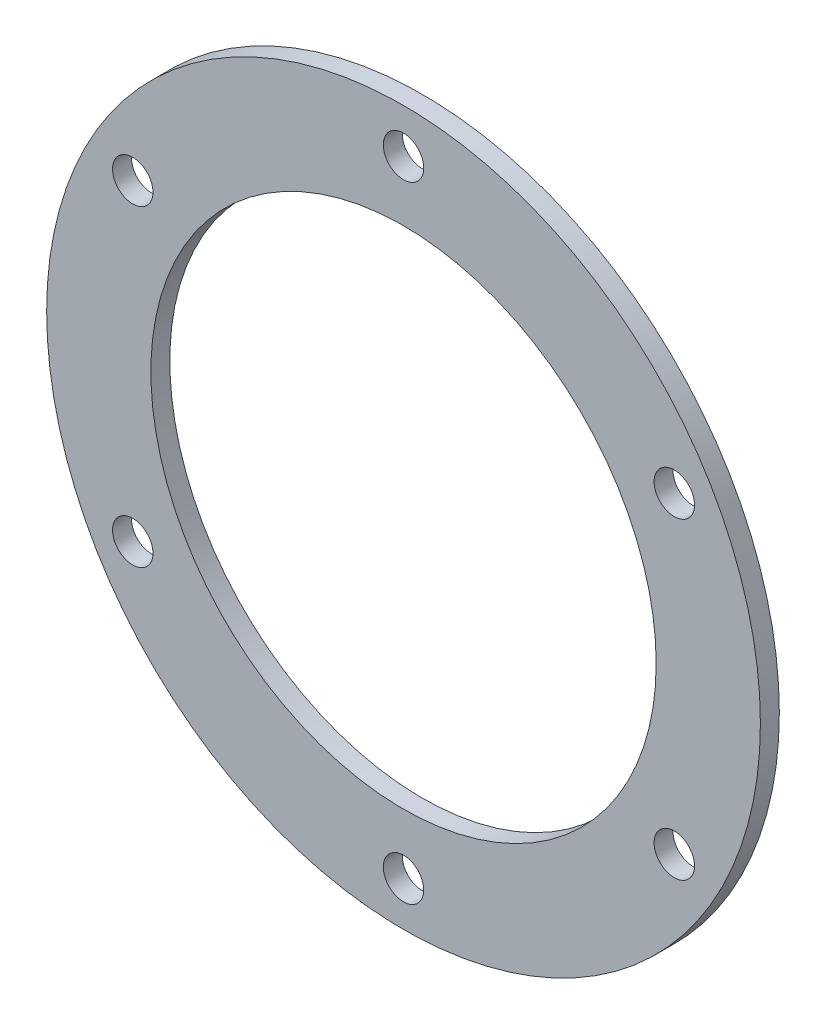
ISO-10303-21;
HEADER;
FILE_DESCRIPTION(('STEP AP214'),'2;1');
FILE_NAME('part.step','',(''),(''),'','','');
FILE_SCHEMA(('AUTOMOTIVE_DESIGN { 1 0 10303 214 1 1 1 1 }'));
ENDSEC;
DATA;
#1=APPLICATION_CONTEXT('core data for automotive mechanical design processes');
#2=APPLICATION_PROTOCOL_DEFINITION('international standard','automotive_design',2000,#1);
#3=PRODUCT_CONTEXT('',#1,'mechanical');
#4=PRODUCT('Part','Part','',(#3));
#5=PRODUCT_RELATED_PRODUCT_CATEGORY('part','',(#4));
#6=PRODUCT_DEFINITION_FORMATION('','',#4);
#7=PRODUCT_DEFINITION_CONTEXT('part definition',#1,'design');
#8=PRODUCT_DEFINITION('design','',#6,#7);
#9=PRODUCT_DEFINITION_SHAPE('','',#8);
#10=(LENGTH_UNIT() NAMED_UNIT(*) SI_UNIT(.MILLI.,.METRE.));
#11=(NAMED_UNIT(*) PLANE_ANGLE_UNIT() SI_UNIT($,.RADIAN.));
#12=(NAMED_UNIT(*) SI_UNIT($,.STERADIAN.) SOLID_ANGLE_UNIT());
#13=UNCERTAINTY_MEASURE_WITH_UNIT(LENGTH_MEASURE(1.E-05),#10,'distance_accuracy_value','');
#14=(GEOMETRIC_REPRESENTATION_CONTEXT(3) GLOBAL_UNCERTAINTY_ASSIGNED_CONTEXT((#13)) GLOBAL_UNIT_ASSIGNED_CONTEXT((#10,
#11,#12)) REPRESENTATION_CONTEXT('',''));
#15=CARTESIAN_POINT('',(0.,0.,0.));
#16=DIRECTION('',(0.,0.,1.));
#17=DIRECTION('',(1.,0.,0.));
#18=AXIS2_PLACEMENT_3D('',#15,#16,#17);
#19=CARTESIAN_POINT('',(0.,0.,1.5));
#20=DIRECTION('',(0.,0.,1.));
#21=DIRECTION('',(1.,0.,0.));
#22=AXIS2_PLACEMENT_3D('',#19,#20,#21);
#23=PLANE('',#22);
#24=CARTESIAN_POINT('',(0.,24.75,1.5));
#25=DIRECTION('',(0.,0.,1.));
#26=DIRECTION('',(1.,0.,0.));
#27=AXIS2_PLACEMENT_3D('',#24,#25,#26);
#28=CIRCLE('',#27,1.6);
#29=CARTESIAN_POINT('',(1.6,24.75,1.5));
#30=VERTEX_POINT('',#29);
#31=EDGE_CURVE('E75',#30,#30,#28,.T.);
#32=ORIENTED_EDGE('',*,*,#31,.F.);
#33=EDGE_LOOP('',(#32));
#34=FACE_BOUND('',#33,.T.);
#35=CARTESIAN_POINT('',(-21.4341287436649,12.375,1.5));
#36=DIRECTION('',(0.,0.,1.));
#37=DIRECTION('',(1.,0.,0.));
#38=AXIS2_PLACEMENT_3D('',#35,#36,#37);
#39=CIRCLE('',#38,1.6);
#40=CARTESIAN_POINT('',(-19.8341287436649,12.375,1.5));
#41=VERTEX_POINT('',#40);
#42=EDGE_CURVE('E80',#41,#41,#39,.T.);
#43=ORIENTED_EDGE('',*,*,#42,.F.);
#44=EDGE_LOOP('',(#43));
#45=FACE_BOUND('',#44,.T.);
#46=CARTESIAN_POINT('',(-21.4341287436649,-12.375,1.5));
#47=DIRECTION('',(0.,0.,1.));
#48=DIRECTION('',(1.,0.,0.));
#49=AXIS2_PLACEMENT_3D('',#46,#47,#48);
#50=CIRCLE('',#49,1.6);
#51=CARTESIAN_POINT('',(-19.8341287436649,-12.375,1.5));
#52=VERTEX_POINT('',#51);
#53=EDGE_CURVE('E56',#52,#52,#50,.T.);
#54=ORIENTED_EDGE('',*,*,#53,.F.);
#55=EDGE_LOOP('',(#54));
#56=FACE_BOUND('',#55,.T.);
#57=CARTESIAN_POINT('',(0.,-24.75,1.5));
#58=DIRECTION('',(0.,0.,1.));
#59=DIRECTION('',(1.,0.,0.));
#60=AXIS2_PLACEMENT_3D('',#57,#58,#59);
#61=CIRCLE('',#60,1.6);
#62=CARTESIAN_POINT('',(1.6,-24.75,1.5));
#63=VERTEX_POINT('',#62);
#64=EDGE_CURVE('E55',#63,#63,#61,.T.);
#65=ORIENTED_EDGE('',*,*,#64,.F.);
#66=EDGE_LOOP('',(#65));
#67=FACE_BOUND('',#66,.T.);
#68=CARTESIAN_POINT('',(21.4341287436649,-12.375,1.5));
#69=DIRECTION('',(0.,0.,1.));
#70=DIRECTION('',(1.,0.,0.));
#71=AXIS2_PLACEMENT_3D('',#68,#69,#70);
#72=CIRCLE('',#71,1.6);
#73=CARTESIAN_POINT('',(23.0341287436649,-12.375,1.5));
#74=VERTEX_POINT('',#73);
#75=EDGE_CURVE('E63',#74,#74,#72,.T.);
#76=ORIENTED_EDGE('',*,*,#75,.F.);
#77=EDGE_LOOP('',(#76));
#78=FACE_BOUND('',#77,.T.);
#79=CARTESIAN_POINT('',(21.4341287436649,12.375,1.5));
#80=DIRECTION('',(0.,0.,1.));
#81=DIRECTION('',(1.,0.,0.));
#82=AXIS2_PLACEMENT_3D('',#79,#80,#81);
#83=CIRCLE('',#82,1.6);
#84=CARTESIAN_POINT('',(23.0341287436649,12.375,1.5));
#85=VERTEX_POINT('',#84);
#86=EDGE_CURVE('E69',#85,#85,#83,.T.);
#87=ORIENTED_EDGE('',*,*,#86,.F.);
#88=EDGE_LOOP('',(#87));
#89=FACE_BOUND('',#88,.T.);
#90=CARTESIAN_POINT('',(0.,0.,1.5));
#91=DIRECTION('',(0.,0.,1.));
#92=DIRECTION('',(1.,0.,0.));
#93=AXIS2_PLACEMENT_3D('',#90,#91,#92);
#94=CIRCLE('',#93,28.25);
#95=CARTESIAN_POINT('',(28.25,0.,1.5));
#96=VERTEX_POINT('',#95);
#97=EDGE_CURVE('E10',#96,#96,#94,.T.);
#98=ORIENTED_EDGE('',*,*,#97,.T.);
#99=EDGE_LOOP('',(#98));
#100=FACE_BOUND('',#99,.T.);
#101=CARTESIAN_POINT('',(0.,0.,1.5));
#102=DIRECTION('',(0.,0.,1.));
#103=DIRECTION('',(1.,0.,0.));
#104=AXIS2_PLACEMENT_3D('',#101,#102,#103);
#105=CIRCLE('',#104,20.);
#106=CARTESIAN_POINT('',(20.,0.,1.5));
#107=VERTEX_POINT('',#106);
#108=EDGE_CURVE('E44',#107,#107,#105,.T.);
#109=ORIENTED_EDGE('',*,*,#108,.F.);
#110=EDGE_LOOP('',(#109));
#111=FACE_BOUND('',#110,.T.);
#112=ADVANCED_FACE('F33',(#34,#45,#56,#67,#78,#89,#100,#111),#23,.T.);
#113=CARTESIAN_POINT('',(0.,0.,0.));
#114=DIRECTION('',(0.,0.,1.));
#115=DIRECTION('',(1.,0.,0.));
#116=AXIS2_PLACEMENT_3D('',#113,#114,#115);
#117=PLANE('',#116);
#118=CARTESIAN_POINT('',(0.,24.75,0.));
#119=DIRECTION('',(0.,0.,1.));
#120=DIRECTION('',(1.,0.,0.));
#121=AXIS2_PLACEMENT_3D('',#118,#119,#120);
#122=CIRCLE('',#121,1.6);
#123=CARTESIAN_POINT('',(1.6,24.75,0.));
#124=VERTEX_POINT('',#123);
#125=EDGE_CURVE('E49',#124,#124,#122,.F.);
#126=ORIENTED_EDGE('',*,*,#125,.F.);
#127=EDGE_LOOP('',(#126));
#128=FACE_BOUND('',#127,.T.);
#129=CARTESIAN_POINT('',(-21.4341287436649,12.375,0.));
#130=DIRECTION('',(0.,0.,1.));
#131=DIRECTION('',(1.,0.,0.));
#132=AXIS2_PLACEMENT_3D('',#129,#130,#131);
#133=CIRCLE('',#132,1.6);
#134=CARTESIAN_POINT('',(-19.8341287436649,12.375,0.));
#135=VERTEX_POINT('',#134);
#136=EDGE_CURVE('E59',#135,#135,#133,.F.);
#137=ORIENTED_EDGE('',*,*,#136,.F.);
#138=EDGE_LOOP('',(#137));
#139=FACE_BOUND('',#138,.T.);
#140=CARTESIAN_POINT('',(-21.4341287436649,-12.375,0.));
#141=DIRECTION('',(0.,0.,1.));
#142=DIRECTION('',(1.,0.,0.));
#143=AXIS2_PLACEMENT_3D('',#140,#141,#142);
#144=CIRCLE('',#143,1.6);
#145=CARTESIAN_POINT('',(-19.8341287436649,-12.375,0.));
#146=VERTEX_POINT('',#145);
#147=EDGE_CURVE('E52',#146,#146,#144,.F.);
#148=ORIENTED_EDGE('',*,*,#147,.F.);
#149=EDGE_LOOP('',(#148));
#150=FACE_BOUND('',#149,.T.);
#151=CARTESIAN_POINT('',(0.,-24.75,0.));
#152=DIRECTION('',(0.,0.,1.));
#153=DIRECTION('',(1.,0.,0.));
#154=AXIS2_PLACEMENT_3D('',#151,#152,#153);
#155=CIRCLE('',#154,1.6);
#156=CARTESIAN_POINT('',(1.6,-24.75,0.));
#157=VERTEX_POINT('',#156);
#158=EDGE_CURVE('E60',#157,#157,#155,.F.);
#159=ORIENTED_EDGE('',*,*,#158,.F.);
#160=EDGE_LOOP('',(#159));
#161=FACE_BOUND('',#160,.T.);
#162=CARTESIAN_POINT('',(21.4341287436649,-12.375,0.));
#163=DIRECTION('',(0.,0.,1.));
#164=DIRECTION('',(1.,0.,0.));
#165=AXIS2_PLACEMENT_3D('',#162,#163,#164);
#166=CIRCLE('',#165,1.6);
#167=CARTESIAN_POINT('',(23.0341287436649,-12.375,0.));
#168=VERTEX_POINT('',#167);
#169=EDGE_CURVE('E66',#168,#168,#166,.F.);
#170=ORIENTED_EDGE('',*,*,#169,.F.);
#171=EDGE_LOOP('',(#170));
#172=FACE_BOUND('',#171,.T.);
#173=CARTESIAN_POINT('',(21.4341287436649,12.375,0.));
#174=DIRECTION('',(0.,0.,1.));
#175=DIRECTION('',(1.,0.,0.));
#176=AXIS2_PLACEMENT_3D('',#173,#174,#175);
#177=CIRCLE('',#176,1.6);
#178=CARTESIAN_POINT('',(23.0341287436649,12.375,0.));
#179=VERTEX_POINT('',#178);
#180=EDGE_CURVE('E72',#179,#179,#177,.F.);
#181=ORIENTED_EDGE('',*,*,#180,.F.);
#182=EDGE_LOOP('',(#181));
#183=FACE_BOUND('',#182,.T.);
#184=CARTESIAN_POINT('',(0.,0.,0.));
#185=DIRECTION('',(0.,0.,1.));
#186=DIRECTION('',(1.,0.,0.));
#187=AXIS2_PLACEMENT_3D('',#184,#185,#186);
#188=CIRCLE('',#187,28.25);
#189=CARTESIAN_POINT('',(28.25,0.,0.));
#190=VERTEX_POINT('',#189);
#191=EDGE_CURVE('E37',#190,#190,#188,.T.);
#192=ORIENTED_EDGE('',*,*,#191,.F.);
#193=EDGE_LOOP('',(#192));
#194=FACE_BOUND('',#193,.T.);
#195=CARTESIAN_POINT('',(0.,0.,0.));
#196=DIRECTION('',(0.,0.,1.));
#197=DIRECTION('',(1.,0.,0.));
#198=AXIS2_PLACEMENT_3D('',#195,#196,#197);
#199=CIRCLE('',#198,20.);
#200=CARTESIAN_POINT('',(20.,0.,0.));
#201=VERTEX_POINT('',#200);
#202=EDGE_CURVE('E46',#201,#201,#199,.T.);
#203=ORIENTED_EDGE('',*,*,#202,.T.);
#204=EDGE_LOOP('',(#203));
#205=FACE_BOUND('',#204,.T.);
#206=ADVANCED_FACE('F92',(#128,#139,#150,#161,#172,#183,#194,#205),#117,.F.);
#207=CARTESIAN_POINT('',(0.,0.,1.5));
#208=DIRECTION('',(0.,0.,-1.));
#209=DIRECTION('',(-1.,0.,0.));
#210=AXIS2_PLACEMENT_3D('',#207,#208,#209);
#211=CYLINDRICAL_SURFACE('',#210,28.25);
#212=ORIENTED_EDGE('',*,*,#97,.F.);
#213=EDGE_LOOP('',(#212));
#214=FACE_BOUND('',#213,.T.);
#215=ORIENTED_EDGE('',*,*,#191,.T.);
#216=EDGE_LOOP('',(#215));
#217=FACE_BOUND('',#216,.T.);
#218=ADVANCED_FACE('F35',(#214,#217),#211,.T.);
#219=CARTESIAN_POINT('',(0.,0.,1.5));
#220=DIRECTION('',(0.,0.,-1.));
#221=DIRECTION('',(-1.,0.,0.));
#222=AXIS2_PLACEMENT_3D('',#219,#220,#221);
#223=CYLINDRICAL_SURFACE('',#222,20.);
#224=ORIENTED_EDGE('',*,*,#108,.T.);
#225=EDGE_LOOP('',(#224));
#226=FACE_BOUND('',#225,.T.);
#227=ORIENTED_EDGE('',*,*,#202,.F.);
#228=EDGE_LOOP('',(#227));
#229=FACE_BOUND('',#228,.T.);
#230=ADVANCED_FACE('F106',(#226,#229),#223,.F.);
#231=CARTESIAN_POINT('',(21.4341287436649,12.375,-4.52548339959391));
#232=DIRECTION('',(0.,0.,1.));
#233=DIRECTION('',(1.,0.,0.));
#234=AXIS2_PLACEMENT_3D('',#231,#232,#233);
#235=CYLINDRICAL_SURFACE('',#234,1.6);
#236=ORIENTED_EDGE('',*,*,#180,.T.);
#237=EDGE_LOOP('',(#236));
#238=FACE_BOUND('',#237,.T.);
#239=ORIENTED_EDGE('',*,*,#86,.T.);
#240=EDGE_LOOP('',(#239));
#241=FACE_BOUND('',#240,.T.);
#242=ADVANCED_FACE('F109',(#238,#241),#235,.F.);
#243=CARTESIAN_POINT('',(21.4341287436649,-12.375,-4.52548339959391));
#244=DIRECTION('',(0.,0.,1.));
#245=DIRECTION('',(1.,0.,0.));
#246=AXIS2_PLACEMENT_3D('',#243,#244,#245);
#247=CYLINDRICAL_SURFACE('',#246,1.6);
#248=ORIENTED_EDGE('',*,*,#169,.T.);
#249=EDGE_LOOP('',(#248));
#250=FACE_BOUND('',#249,.T.);
#251=ORIENTED_EDGE('',*,*,#75,.T.);
#252=EDGE_LOOP('',(#251));
#253=FACE_BOUND('',#252,.T.);
#254=ADVANCED_FACE('F130',(#250,#253),#247,.F.);
#255=CARTESIAN_POINT('',(0.,-24.75,-4.52548339959391));
#256=DIRECTION('',(0.,0.,1.));
#257=DIRECTION('',(1.,0.,0.));
#258=AXIS2_PLACEMENT_3D('',#255,#256,#257);
#259=CYLINDRICAL_SURFACE('',#258,1.6);
#260=ORIENTED_EDGE('',*,*,#158,.T.);
#261=EDGE_LOOP('',(#260));
#262=FACE_BOUND('',#261,.T.);
#263=ORIENTED_EDGE('',*,*,#64,.T.);
#264=EDGE_LOOP('',(#263));
#265=FACE_BOUND('',#264,.T.);
#266=ADVANCED_FACE('F126',(#262,#265),#259,.F.);
#267=CARTESIAN_POINT('',(-21.4341287436649,-12.375,-4.52548339959391));
#268=DIRECTION('',(0.,0.,1.));
#269=DIRECTION('',(1.,0.,0.));
#270=AXIS2_PLACEMENT_3D('',#267,#268,#269);
#271=CYLINDRICAL_SURFACE('',#270,1.6);
#272=ORIENTED_EDGE('',*,*,#147,.T.);
#273=EDGE_LOOP('',(#272));
#274=FACE_BOUND('',#273,.T.);
#275=ORIENTED_EDGE('',*,*,#53,.T.);
#276=EDGE_LOOP('',(#275));
#277=FACE_BOUND('',#276,.T.);
#278=ADVANCED_FACE('F122',(#274,#277),#271,.F.);
#279=CARTESIAN_POINT('',(-21.4341287436649,12.375,-4.52548339959391));
#280=DIRECTION('',(0.,0.,1.));
#281=DIRECTION('',(1.,0.,0.));
#282=AXIS2_PLACEMENT_3D('',#279,#280,#281);
#283=CYLINDRICAL_SURFACE('',#282,1.6);
#284=ORIENTED_EDGE('',*,*,#136,.T.);
#285=EDGE_LOOP('',(#284));
#286=FACE_BOUND('',#285,.T.);
#287=ORIENTED_EDGE('',*,*,#42,.T.);
#288=EDGE_LOOP('',(#287));
#289=FACE_BOUND('',#288,.T.);
#290=ADVANCED_FACE('F125',(#286,#289),#283,.F.);
#291=CARTESIAN_POINT('',(0.,24.75,-4.52548339959391));
#292=DIRECTION('',(0.,0.,1.));
#293=DIRECTION('',(1.,0.,0.));
#294=AXIS2_PLACEMENT_3D('',#291,#292,#293);
#295=CYLINDRICAL_SURFACE('',#294,1.6);
#296=ORIENTED_EDGE('',*,*,#125,.T.);
#297=EDGE_LOOP('',(#296));
#298=FACE_BOUND('',#297,.T.);
#299=ORIENTED_EDGE('',*,*,#31,.T.);
#300=EDGE_LOOP('',(#299));
#301=FACE_BOUND('',#300,.T.);
#302=ADVANCED_FACE('F88',(#298,#301),#295,.F.);
#303=CLOSED_SHELL('',(#112,#206,#218,#230,#242,#254,#266,#278,#290,#302));
#304=MANIFOLD_SOLID_BREP('B2',#303);
#305=ADVANCED_BREP_SHAPE_REPRESENTATION('',(#18,#304),#14);
#306=SHAPE_DEFINITION_REPRESENTATION(#9,#305);
ENDSEC;
END-ISO-10303-21;
